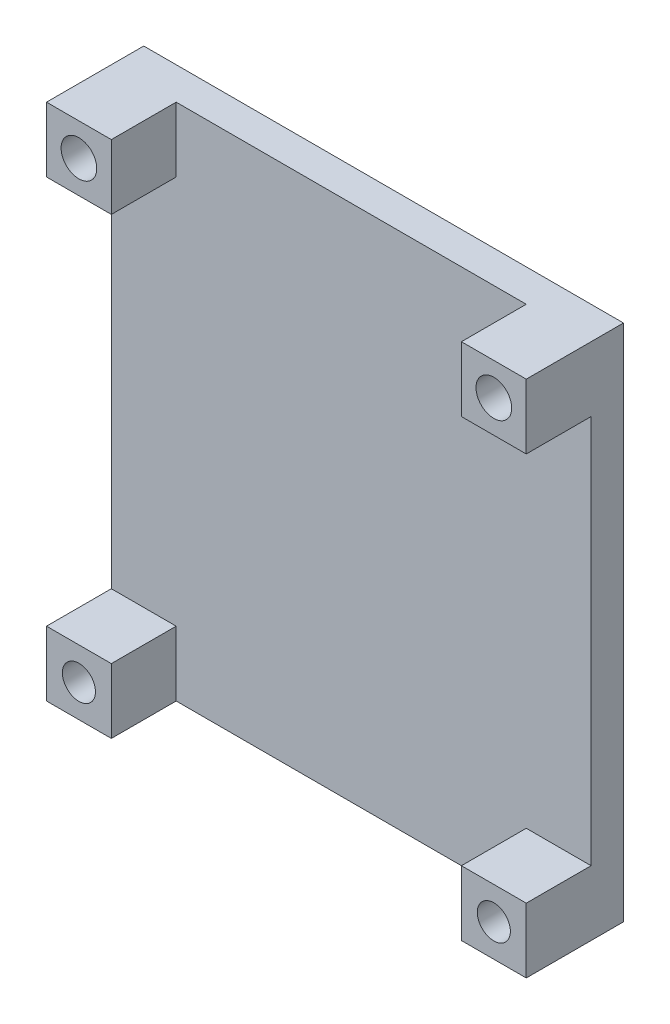
ISO-10303-21;
HEADER;
FILE_DESCRIPTION(('STEP AP214'),'2;1');
FILE_NAME('part.step','',(''),(''),'','','');
FILE_SCHEMA(('AUTOMOTIVE_DESIGN { 1 0 10303 214 1 1 1 1 }'));
ENDSEC;
DATA;
#1=APPLICATION_CONTEXT('core data for automotive mechanical design processes');
#2=APPLICATION_PROTOCOL_DEFINITION('international standard','automotive_design',2000,#1);
#3=PRODUCT_CONTEXT('',#1,'mechanical');
#4=PRODUCT('Part','Part','',(#3));
#5=PRODUCT_RELATED_PRODUCT_CATEGORY('part','',(#4));
#6=PRODUCT_DEFINITION_FORMATION('','',#4);
#7=PRODUCT_DEFINITION_CONTEXT('part definition',#1,'design');
#8=PRODUCT_DEFINITION('design','',#6,#7);
#9=PRODUCT_DEFINITION_SHAPE('','',#8);
#10=(LENGTH_UNIT() NAMED_UNIT(*) SI_UNIT(.MILLI.,.METRE.));
#11=(NAMED_UNIT(*) PLANE_ANGLE_UNIT() SI_UNIT($,.RADIAN.));
#12=(NAMED_UNIT(*) SI_UNIT($,.STERADIAN.) SOLID_ANGLE_UNIT());
#13=UNCERTAINTY_MEASURE_WITH_UNIT(LENGTH_MEASURE(1.E-05),#10,'distance_accuracy_value','');
#14=(GEOMETRIC_REPRESENTATION_CONTEXT(3) GLOBAL_UNCERTAINTY_ASSIGNED_CONTEXT((#13)) GLOBAL_UNIT_ASSIGNED_CONTEXT((#10,
#11,#12)) REPRESENTATION_CONTEXT('',''));
#15=CARTESIAN_POINT('',(0.,0.,0.));
#16=DIRECTION('',(0.,0.,1.));
#17=DIRECTION('',(1.,0.,0.));
#18=AXIS2_PLACEMENT_3D('',#15,#16,#17);
#19=CARTESIAN_POINT('',(0.,0.,5.));
#20=DIRECTION('',(0.,0.,-1.));
#21=DIRECTION('',(-1.,0.,0.));
#22=AXIS2_PLACEMENT_3D('',#19,#20,#21);
#23=PLANE('',#22);
#24=DIRECTION('',(1.,0.,0.));
#25=VECTOR('',#24,1.);
#26=CARTESIAN_POINT('',(0.,-28.7636253041362,5.));
#27=LINE('',#26,#25);
#28=CARTESIAN_POINT('',(-66.3018892791014,-28.7636253041362,5.));
#29=VERTEX_POINT('',#28);
#30=CARTESIAN_POINT('',(-56.3018892791014,-28.7636253041362,5.));
#31=VERTEX_POINT('',#30);
#32=EDGE_CURVE('E50',#29,#31,#27,.T.);
#33=ORIENTED_EDGE('',*,*,#32,.T.);
#34=DIRECTION('',(0.,-1.,0.));
#35=VECTOR('',#34,1.);
#36=CARTESIAN_POINT('',(-56.3018892791014,0.,5.));
#37=LINE('',#36,#35);
#38=CARTESIAN_POINT('',(-56.3018892791014,-38.7636253041362,5.));
#39=VERTEX_POINT('',#38);
#40=EDGE_CURVE('E154',#31,#39,#37,.T.);
#41=ORIENTED_EDGE('',*,*,#40,.T.);
#42=DIRECTION('',(1.,0.,0.));
#43=VECTOR('',#42,1.);
#44=CARTESIAN_POINT('',(7.6981107208986,-38.7636253041362,5.));
#45=LINE('',#44,#43);
#46=CARTESIAN_POINT('',(-2.30188927910142,-38.7636253041362,5.));
#47=VERTEX_POINT('',#46);
#48=EDGE_CURVE('E299',#39,#47,#45,.T.);
#49=ORIENTED_EDGE('',*,*,#48,.T.);
#50=DIRECTION('',(0.,-1.,0.));
#51=VECTOR('',#50,1.);
#52=CARTESIAN_POINT('',(-2.30188927910142,0.,5.));
#53=LINE('',#52,#51);
#54=CARTESIAN_POINT('',(-2.30188927910142,-28.7636253041362,5.));
#55=VERTEX_POINT('',#54);
#56=EDGE_CURVE('E190',#55,#47,#53,.T.);
#57=ORIENTED_EDGE('',*,*,#56,.F.);
#58=DIRECTION('',(-1.,0.,0.));
#59=VECTOR('',#58,1.);
#60=CARTESIAN_POINT('',(0.,-28.7636253041362,5.));
#61=LINE('',#60,#59);
#62=CARTESIAN_POINT('',(7.6981107208986,-28.7636253041362,5.));
#63=VERTEX_POINT('',#62);
#64=EDGE_CURVE('E157',#63,#55,#61,.T.);
#65=ORIENTED_EDGE('',*,*,#64,.F.);
#66=DIRECTION('',(0.,1.,0.));
#67=VECTOR('',#66,1.);
#68=CARTESIAN_POINT('',(7.69811072089859,41.2363746958637,5.));
#69=LINE('',#68,#67);
#70=CARTESIAN_POINT('',(7.69811072089859,31.2363746958638,5.));
#71=VERTEX_POINT('',#70);
#72=EDGE_CURVE('E273',#63,#71,#69,.T.);
#73=ORIENTED_EDGE('',*,*,#72,.T.);
#74=DIRECTION('',(1.,0.,0.));
#75=VECTOR('',#74,1.);
#76=CARTESIAN_POINT('',(0.,31.2363746958638,5.));
#77=LINE('',#76,#75);
#78=CARTESIAN_POINT('',(-2.30188927910142,31.2363746958638,5.));
#79=VERTEX_POINT('',#78);
#80=EDGE_CURVE('E218',#79,#71,#77,.T.);
#81=ORIENTED_EDGE('',*,*,#80,.F.);
#82=DIRECTION('',(0.,-1.,0.));
#83=VECTOR('',#82,1.);
#84=CARTESIAN_POINT('',(-2.30188927910142,0.,5.));
#85=LINE('',#84,#83);
#86=CARTESIAN_POINT('',(-2.30188927910142,41.2363746958637,5.));
#87=VERTEX_POINT('',#86);
#88=EDGE_CURVE('E213',#87,#79,#85,.T.);
#89=ORIENTED_EDGE('',*,*,#88,.F.);
#90=DIRECTION('',(-1.,0.,0.));
#91=VECTOR('',#90,1.);
#92=CARTESIAN_POINT('',(-66.3018892791014,41.2363746958637,5.));
#93=LINE('',#92,#91);
#94=CARTESIAN_POINT('',(-56.3018892791014,41.2363746958637,5.));
#95=VERTEX_POINT('',#94);
#96=EDGE_CURVE('E270',#87,#95,#93,.T.);
#97=ORIENTED_EDGE('',*,*,#96,.T.);
#98=DIRECTION('',(0.,-1.,0.));
#99=VECTOR('',#98,1.);
#100=CARTESIAN_POINT('',(-56.3018892791014,0.,5.));
#101=LINE('',#100,#99);
#102=CARTESIAN_POINT('',(-56.3018892791014,31.2363746958637,5.));
#103=VERTEX_POINT('',#102);
#104=EDGE_CURVE('E246',#95,#103,#101,.T.);
#105=ORIENTED_EDGE('',*,*,#104,.T.);
#106=DIRECTION('',(-1.,0.,0.));
#107=VECTOR('',#106,1.);
#108=CARTESIAN_POINT('',(0.,31.2363746958637,5.));
#109=LINE('',#108,#107);
#110=CARTESIAN_POINT('',(-66.3018892791014,31.2363746958637,5.));
#111=VERTEX_POINT('',#110);
#112=EDGE_CURVE('E260',#103,#111,#109,.T.);
#113=ORIENTED_EDGE('',*,*,#112,.T.);
#114=DIRECTION('',(0.,-1.,0.));
#115=VECTOR('',#114,1.);
#116=CARTESIAN_POINT('',(-66.3018892791014,-38.7636253041362,5.));
#117=LINE('',#116,#115);
#118=EDGE_CURVE('E55',#111,#29,#117,.T.);
#119=ORIENTED_EDGE('',*,*,#118,.T.);
#120=EDGE_LOOP('',(#33,#41,#49,#57,#65,#73,#81,#89,#97,#105,#113,#119));
#121=FACE_BOUND('',#120,.T.);
#122=ADVANCED_FACE('F35',(#121),#23,.F.);
#123=CARTESIAN_POINT('',(-66.3018892791014,-38.7636253041362,5.));
#124=DIRECTION('',(1.,0.,0.));
#125=DIRECTION('',(0.,0.,-1.));
#126=AXIS2_PLACEMENT_3D('',#123,#124,#125);
#127=PLANE('',#126);
#128=DIRECTION('',(0.,-1.,0.));
#129=VECTOR('',#128,1.);
#130=CARTESIAN_POINT('',(-66.3018892791014,-38.7636253041362,0.));
#131=LINE('',#130,#129);
#132=CARTESIAN_POINT('',(-66.3018892791014,41.2363746958637,0.));
#133=VERTEX_POINT('',#132);
#134=CARTESIAN_POINT('',(-66.3018892791014,-38.7636253041362,0.));
#135=VERTEX_POINT('',#134);
#136=EDGE_CURVE('E278',#133,#135,#131,.T.);
#137=ORIENTED_EDGE('',*,*,#136,.T.);
#138=DIRECTION('',(0.,0.,-1.));
#139=VECTOR('',#138,1.);
#140=CARTESIAN_POINT('',(-66.3018892791014,-38.7636253041362,5.));
#141=LINE('',#140,#139);
#142=CARTESIAN_POINT('',(-66.3018892791014,-38.7636253041362,15.));
#143=VERTEX_POINT('',#142);
#144=EDGE_CURVE('E295',#143,#135,#141,.T.);
#145=ORIENTED_EDGE('',*,*,#144,.F.);
#146=DIRECTION('',(0.,-1.,0.));
#147=VECTOR('',#146,1.);
#148=CARTESIAN_POINT('',(-66.3018892791014,0.,15.));
#149=LINE('',#148,#147);
#150=CARTESIAN_POINT('',(-66.3018892791014,-28.7636253041362,15.));
#151=VERTEX_POINT('',#150);
#152=EDGE_CURVE('E172',#151,#143,#149,.T.);
#153=ORIENTED_EDGE('',*,*,#152,.F.);
#154=DIRECTION('',(0.,0.,-1.));
#155=VECTOR('',#154,1.);
#156=CARTESIAN_POINT('',(-66.3018892791014,-28.7636253041362,15.));
#157=LINE('',#156,#155);
#158=EDGE_CURVE('E158',#151,#29,#157,.T.);
#159=ORIENTED_EDGE('',*,*,#158,.T.);
#160=ORIENTED_EDGE('',*,*,#118,.F.);
#161=DIRECTION('',(0.,0.,-1.));
#162=VECTOR('',#161,1.);
#163=CARTESIAN_POINT('',(-66.3018892791014,31.2363746958637,15.));
#164=LINE('',#163,#162);
#165=CARTESIAN_POINT('',(-66.3018892791014,31.2363746958637,15.));
#166=VERTEX_POINT('',#165);
#167=EDGE_CURVE('E257',#166,#111,#164,.T.);
#168=ORIENTED_EDGE('',*,*,#167,.F.);
#169=DIRECTION('',(0.,-1.,0.));
#170=VECTOR('',#169,1.);
#171=CARTESIAN_POINT('',(-66.3018892791014,0.,15.));
#172=LINE('',#171,#170);
#173=CARTESIAN_POINT('',(-66.3018892791014,41.2363746958637,15.));
#174=VERTEX_POINT('',#173);
#175=EDGE_CURVE('E255',#174,#166,#172,.T.);
#176=ORIENTED_EDGE('',*,*,#175,.F.);
#177=DIRECTION('',(0.,0.,-1.));
#178=VECTOR('',#177,1.);
#179=CARTESIAN_POINT('',(-66.3018892791014,41.2363746958637,5.));
#180=LINE('',#179,#178);
#181=EDGE_CURVE('E272',#174,#133,#180,.T.);
#182=ORIENTED_EDGE('',*,*,#181,.T.);
#183=EDGE_LOOP('',(#137,#145,#153,#159,#160,#168,#176,#182));
#184=FACE_BOUND('',#183,.T.);
#185=ADVANCED_FACE('F37',(#184),#127,.F.);
#186=CARTESIAN_POINT('',(7.6981107208986,-38.7636253041362,5.));
#187=DIRECTION('',(0.,1.,0.));
#188=DIRECTION('',(-1.,0.,0.));
#189=AXIS2_PLACEMENT_3D('',#186,#187,#188);
#190=PLANE('',#189);
#191=DIRECTION('',(1.,0.,0.));
#192=VECTOR('',#191,1.);
#193=CARTESIAN_POINT('',(7.6981107208986,-38.7636253041362,0.));
#194=LINE('',#193,#192);
#195=CARTESIAN_POINT('',(7.6981107208986,-38.7636253041362,0.));
#196=VERTEX_POINT('',#195);
#197=EDGE_CURVE('E281',#135,#196,#194,.T.);
#198=ORIENTED_EDGE('',*,*,#197,.T.);
#199=DIRECTION('',(0.,0.,-1.));
#200=VECTOR('',#199,1.);
#201=CARTESIAN_POINT('',(7.6981107208986,-38.7636253041362,5.));
#202=LINE('',#201,#200);
#203=CARTESIAN_POINT('',(7.6981107208986,-38.7636253041362,15.));
#204=VERTEX_POINT('',#203);
#205=EDGE_CURVE('E292',#204,#196,#202,.T.);
#206=ORIENTED_EDGE('',*,*,#205,.F.);
#207=DIRECTION('',(1.,0.,0.));
#208=VECTOR('',#207,1.);
#209=CARTESIAN_POINT('',(0.,-38.7636253041362,15.));
#210=LINE('',#209,#208);
#211=CARTESIAN_POINT('',(-2.30188927910142,-38.7636253041362,15.));
#212=VERTEX_POINT('',#211);
#213=EDGE_CURVE('E194',#212,#204,#210,.T.);
#214=ORIENTED_EDGE('',*,*,#213,.F.);
#215=DIRECTION('',(0.,0.,-1.));
#216=VECTOR('',#215,1.);
#217=CARTESIAN_POINT('',(-2.30188927910142,-38.7636253041362,15.));
#218=LINE('',#217,#216);
#219=EDGE_CURVE('E200',#212,#47,#218,.T.);
#220=ORIENTED_EDGE('',*,*,#219,.T.);
#221=ORIENTED_EDGE('',*,*,#48,.F.);
#222=DIRECTION('',(0.,0.,-1.));
#223=VECTOR('',#222,1.);
#224=CARTESIAN_POINT('',(-56.3018892791014,-38.7636253041362,15.));
#225=LINE('',#224,#223);
#226=CARTESIAN_POINT('',(-56.3018892791014,-38.7636253041362,15.));
#227=VERTEX_POINT('',#226);
#228=EDGE_CURVE('E178',#227,#39,#225,.T.);
#229=ORIENTED_EDGE('',*,*,#228,.F.);
#230=DIRECTION('',(1.,0.,0.));
#231=VECTOR('',#230,1.);
#232=CARTESIAN_POINT('',(0.,-38.7636253041362,15.));
#233=LINE('',#232,#231);
#234=EDGE_CURVE('E166',#143,#227,#233,.T.);
#235=ORIENTED_EDGE('',*,*,#234,.F.);
#236=ORIENTED_EDGE('',*,*,#144,.T.);
#237=EDGE_LOOP('',(#198,#206,#214,#220,#221,#229,#235,#236));
#238=FACE_BOUND('',#237,.T.);
#239=ADVANCED_FACE('F344',(#238),#190,.F.);
#240=CARTESIAN_POINT('',(7.69811072089859,41.2363746958637,5.));
#241=DIRECTION('',(-1.,0.,0.));
#242=DIRECTION('',(0.,-1.,0.));
#243=AXIS2_PLACEMENT_3D('',#240,#241,#242);
#244=PLANE('',#243);
#245=DIRECTION('',(0.,1.,0.));
#246=VECTOR('',#245,1.);
#247=CARTESIAN_POINT('',(7.69811072089859,41.2363746958637,0.));
#248=LINE('',#247,#246);
#249=CARTESIAN_POINT('',(7.69811072089859,41.2363746958637,0.));
#250=VERTEX_POINT('',#249);
#251=EDGE_CURVE('E283',#196,#250,#248,.T.);
#252=ORIENTED_EDGE('',*,*,#251,.T.);
#253=DIRECTION('',(0.,0.,-1.));
#254=VECTOR('',#253,1.);
#255=CARTESIAN_POINT('',(7.69811072089859,41.2363746958637,5.));
#256=LINE('',#255,#254);
#257=CARTESIAN_POINT('',(7.69811072089859,41.2363746958637,15.));
#258=VERTEX_POINT('',#257);
#259=EDGE_CURVE('E289',#258,#250,#256,.T.);
#260=ORIENTED_EDGE('',*,*,#259,.F.);
#261=DIRECTION('',(0.,1.,0.));
#262=VECTOR('',#261,1.);
#263=CARTESIAN_POINT('',(7.69811072089859,0.,15.));
#264=LINE('',#263,#262);
#265=CARTESIAN_POINT('',(7.69811072089859,31.2363746958638,15.));
#266=VERTEX_POINT('',#265);
#267=EDGE_CURVE('E222',#266,#258,#264,.T.);
#268=ORIENTED_EDGE('',*,*,#267,.F.);
#269=DIRECTION('',(0.,0.,-1.));
#270=VECTOR('',#269,1.);
#271=CARTESIAN_POINT('',(7.69811072089859,31.2363746958638,15.));
#272=LINE('',#271,#270);
#273=EDGE_CURVE('E228',#266,#71,#272,.T.);
#274=ORIENTED_EDGE('',*,*,#273,.T.);
#275=ORIENTED_EDGE('',*,*,#72,.F.);
#276=DIRECTION('',(0.,0.,-1.));
#277=VECTOR('',#276,1.);
#278=CARTESIAN_POINT('',(7.6981107208986,-28.7636253041362,15.));
#279=LINE('',#278,#277);
#280=CARTESIAN_POINT('',(7.6981107208986,-28.7636253041362,15.));
#281=VERTEX_POINT('',#280);
#282=EDGE_CURVE('E210',#281,#63,#279,.T.);
#283=ORIENTED_EDGE('',*,*,#282,.F.);
#284=DIRECTION('',(0.,1.,0.));
#285=VECTOR('',#284,1.);
#286=CARTESIAN_POINT('',(7.69811072089859,0.,15.));
#287=LINE('',#286,#285);
#288=EDGE_CURVE('E186',#204,#281,#287,.T.);
#289=ORIENTED_EDGE('',*,*,#288,.F.);
#290=ORIENTED_EDGE('',*,*,#205,.T.);
#291=EDGE_LOOP('',(#252,#260,#268,#274,#275,#283,#289,#290));
#292=FACE_BOUND('',#291,.T.);
#293=ADVANCED_FACE('F312',(#292),#244,.F.);
#294=CARTESIAN_POINT('',(-66.3018892791014,41.2363746958637,5.));
#295=DIRECTION('',(0.,-1.,0.));
#296=DIRECTION('',(0.,0.,-1.));
#297=AXIS2_PLACEMENT_3D('',#294,#295,#296);
#298=PLANE('',#297);
#299=DIRECTION('',(-1.,0.,0.));
#300=VECTOR('',#299,1.);
#301=CARTESIAN_POINT('',(-66.3018892791014,41.2363746958637,0.));
#302=LINE('',#301,#300);
#303=EDGE_CURVE('E285',#250,#133,#302,.T.);
#304=ORIENTED_EDGE('',*,*,#303,.T.);
#305=ORIENTED_EDGE('',*,*,#181,.F.);
#306=DIRECTION('',(-1.,0.,0.));
#307=VECTOR('',#306,1.);
#308=CARTESIAN_POINT('',(0.,41.2363746958637,15.));
#309=LINE('',#308,#307);
#310=CARTESIAN_POINT('',(-56.3018892791014,41.2363746958637,15.));
#311=VERTEX_POINT('',#310);
#312=EDGE_CURVE('E252',#311,#174,#309,.T.);
#313=ORIENTED_EDGE('',*,*,#312,.F.);
#314=DIRECTION('',(0.,0.,-1.));
#315=VECTOR('',#314,1.);
#316=CARTESIAN_POINT('',(-56.3018892791014,41.2363746958637,15.));
#317=LINE('',#316,#315);
#318=EDGE_CURVE('E300',#311,#95,#317,.T.);
#319=ORIENTED_EDGE('',*,*,#318,.T.);
#320=ORIENTED_EDGE('',*,*,#96,.F.);
#321=DIRECTION('',(0.,0.,-1.));
#322=VECTOR('',#321,1.);
#323=CARTESIAN_POINT('',(-2.30188927910142,41.2363746958637,15.));
#324=LINE('',#323,#322);
#325=CARTESIAN_POINT('',(-2.30188927910142,41.2363746958637,15.));
#326=VERTEX_POINT('',#325);
#327=EDGE_CURVE('E238',#326,#87,#324,.T.);
#328=ORIENTED_EDGE('',*,*,#327,.F.);
#329=DIRECTION('',(-1.,0.,0.));
#330=VECTOR('',#329,1.);
#331=CARTESIAN_POINT('',(0.,41.2363746958637,15.));
#332=LINE('',#331,#330);
#333=EDGE_CURVE('E214',#258,#326,#332,.T.);
#334=ORIENTED_EDGE('',*,*,#333,.F.);
#335=ORIENTED_EDGE('',*,*,#259,.T.);
#336=EDGE_LOOP('',(#304,#305,#313,#319,#320,#328,#334,#335));
#337=FACE_BOUND('',#336,.T.);
#338=ADVANCED_FACE('F319',(#337),#298,.F.);
#339=CARTESIAN_POINT('',(0.,0.,0.));
#340=DIRECTION('',(0.,0.,-1.));
#341=DIRECTION('',(-1.,0.,0.));
#342=AXIS2_PLACEMENT_3D('',#339,#340,#341);
#343=PLANE('',#342);
#344=ORIENTED_EDGE('',*,*,#136,.F.);
#345=ORIENTED_EDGE('',*,*,#303,.F.);
#346=ORIENTED_EDGE('',*,*,#251,.F.);
#347=ORIENTED_EDGE('',*,*,#197,.F.);
#348=EDGE_LOOP('',(#344,#345,#346,#347));
#349=FACE_BOUND('',#348,.T.);
#350=ADVANCED_FACE('F415',(#349),#343,.T.);
#351=CARTESIAN_POINT('',(0.,31.2363746958637,15.));
#352=DIRECTION('',(0.,-1.,0.));
#353=DIRECTION('',(0.,0.,-1.));
#354=AXIS2_PLACEMENT_3D('',#351,#352,#353);
#355=PLANE('',#354);
#356=ORIENTED_EDGE('',*,*,#112,.F.);
#357=DIRECTION('',(0.,0.,-1.));
#358=VECTOR('',#357,1.);
#359=CARTESIAN_POINT('',(-56.3018892791014,31.2363746958637,15.));
#360=LINE('',#359,#358);
#361=CARTESIAN_POINT('',(-56.3018892791014,31.2363746958637,15.));
#362=VERTEX_POINT('',#361);
#363=EDGE_CURVE('E263',#362,#103,#360,.T.);
#364=ORIENTED_EDGE('',*,*,#363,.F.);
#365=DIRECTION('',(-1.,0.,0.));
#366=VECTOR('',#365,1.);
#367=CARTESIAN_POINT('',(0.,31.2363746958637,15.));
#368=LINE('',#367,#366);
#369=EDGE_CURVE('E245',#362,#166,#368,.T.);
#370=ORIENTED_EDGE('',*,*,#369,.T.);
#371=ORIENTED_EDGE('',*,*,#167,.T.);
#372=EDGE_LOOP('',(#356,#364,#370,#371));
#373=FACE_BOUND('',#372,.T.);
#374=ADVANCED_FACE('F338',(#373),#355,.T.);
#375=CARTESIAN_POINT('',(-56.3018892791014,0.,15.));
#376=DIRECTION('',(1.,0.,0.));
#377=DIRECTION('',(0.,0.,-1.));
#378=AXIS2_PLACEMENT_3D('',#375,#376,#377);
#379=PLANE('',#378);
#380=ORIENTED_EDGE('',*,*,#104,.F.);
#381=ORIENTED_EDGE('',*,*,#318,.F.);
#382=DIRECTION('',(0.,-1.,0.));
#383=VECTOR('',#382,1.);
#384=CARTESIAN_POINT('',(-56.3018892791014,0.,15.));
#385=LINE('',#384,#383);
#386=EDGE_CURVE('E249',#311,#362,#385,.T.);
#387=ORIENTED_EDGE('',*,*,#386,.T.);
#388=ORIENTED_EDGE('',*,*,#363,.T.);
#389=EDGE_LOOP('',(#380,#381,#387,#388));
#390=FACE_BOUND('',#389,.T.);
#391=ADVANCED_FACE('F331',(#390),#379,.T.);
#392=CARTESIAN_POINT('',(-61.3018892791014,36.2363746958637,15.));
#393=DIRECTION('',(0.,0.,-1.));
#394=DIRECTION('',(-1.,0.,0.));
#395=AXIS2_PLACEMENT_3D('',#392,#393,#394);
#396=CYLINDRICAL_SURFACE('',#395,2.75);
#397=CARTESIAN_POINT('',(-61.3018892791014,36.2363746958637,15.));
#398=DIRECTION('',(0.,0.,1.));
#399=DIRECTION('',(1.,0.,0.));
#400=AXIS2_PLACEMENT_3D('',#397,#398,#399);
#401=CIRCLE('',#400,2.75);
#402=CARTESIAN_POINT('',(-58.5518892791014,36.2363746958637,15.));
#403=VERTEX_POINT('',#402);
#404=EDGE_CURVE('E242',#403,#403,#401,.T.);
#405=ORIENTED_EDGE('',*,*,#404,.T.);
#406=EDGE_LOOP('',(#405));
#407=FACE_BOUND('',#406,.T.);
#408=CARTESIAN_POINT('',(-61.3018892791014,36.2363746958637,5.));
#409=DIRECTION('',(0.,0.,1.));
#410=DIRECTION('',(1.,0.,0.));
#411=AXIS2_PLACEMENT_3D('',#408,#409,#410);
#412=CIRCLE('',#411,2.75);
#413=CARTESIAN_POINT('',(-58.5518892791014,36.2363746958637,5.));
#414=VERTEX_POINT('',#413);
#415=EDGE_CURVE('E241',#414,#414,#412,.T.);
#416=ORIENTED_EDGE('',*,*,#415,.F.);
#417=EDGE_LOOP('',(#416));
#418=FACE_BOUND('',#417,.T.);
#419=ADVANCED_FACE('F402',(#407,#418),#396,.F.);
#420=CARTESIAN_POINT('',(0.,0.,15.));
#421=DIRECTION('',(0.,0.,1.));
#422=DIRECTION('',(1.,0.,0.));
#423=AXIS2_PLACEMENT_3D('',#420,#421,#422);
#424=PLANE('',#423);
#425=ORIENTED_EDGE('',*,*,#404,.F.);
#426=EDGE_LOOP('',(#425));
#427=FACE_BOUND('',#426,.T.);
#428=ORIENTED_EDGE('',*,*,#369,.F.);
#429=ORIENTED_EDGE('',*,*,#386,.F.);
#430=ORIENTED_EDGE('',*,*,#312,.T.);
#431=ORIENTED_EDGE('',*,*,#175,.T.);
#432=EDGE_LOOP('',(#428,#429,#430,#431));
#433=FACE_BOUND('',#432,.T.);
#434=ADVANCED_FACE('F395',(#427,#433),#424,.T.);
#435=ORIENTED_EDGE('',*,*,#415,.T.);
#436=EDGE_LOOP('',(#435));
#437=FACE_BOUND('',#436,.T.);
#438=ADVANCED_FACE('F381',(#437),#23,.F.);
#439=CARTESIAN_POINT('',(-2.30188927910142,0.,15.));
#440=DIRECTION('',(1.,0.,0.));
#441=DIRECTION('',(0.,0.,-1.));
#442=AXIS2_PLACEMENT_3D('',#439,#440,#441);
#443=PLANE('',#442);
#444=ORIENTED_EDGE('',*,*,#88,.T.);
#445=DIRECTION('',(0.,0.,-1.));
#446=VECTOR('',#445,1.);
#447=CARTESIAN_POINT('',(-2.30188927910142,31.2363746958638,15.));
#448=LINE('',#447,#446);
#449=CARTESIAN_POINT('',(-2.30188927910142,31.2363746958638,15.));
#450=VERTEX_POINT('',#449);
#451=EDGE_CURVE('E235',#450,#79,#448,.T.);
#452=ORIENTED_EDGE('',*,*,#451,.F.);
#453=DIRECTION('',(0.,-1.,0.));
#454=VECTOR('',#453,1.);
#455=CARTESIAN_POINT('',(-2.30188927910142,0.,15.));
#456=LINE('',#455,#454);
#457=EDGE_CURVE('E217',#326,#450,#456,.T.);
#458=ORIENTED_EDGE('',*,*,#457,.F.);
#459=ORIENTED_EDGE('',*,*,#327,.T.);
#460=EDGE_LOOP('',(#444,#452,#458,#459));
#461=FACE_BOUND('',#460,.T.);
#462=ADVANCED_FACE('F324',(#461),#443,.F.);
#463=CARTESIAN_POINT('',(0.,31.2363746958638,15.));
#464=DIRECTION('',(0.,1.,0.));
#465=DIRECTION('',(0.,0.,1.));
#466=AXIS2_PLACEMENT_3D('',#463,#464,#465);
#467=PLANE('',#466);
#468=ORIENTED_EDGE('',*,*,#80,.T.);
#469=ORIENTED_EDGE('',*,*,#273,.F.);
#470=DIRECTION('',(1.,0.,0.));
#471=VECTOR('',#470,1.);
#472=CARTESIAN_POINT('',(0.,31.2363746958638,15.));
#473=LINE('',#472,#471);
#474=EDGE_CURVE('E220',#450,#266,#473,.T.);
#475=ORIENTED_EDGE('',*,*,#474,.F.);
#476=ORIENTED_EDGE('',*,*,#451,.T.);
#477=EDGE_LOOP('',(#468,#469,#475,#476));
#478=FACE_BOUND('',#477,.T.);
#479=ADVANCED_FACE('F308',(#478),#467,.F.);
#480=CARTESIAN_POINT('',(2.69811072089858,36.2363746958637,15.));
#481=DIRECTION('',(0.,0.,-1.));
#482=DIRECTION('',(-1.,0.,0.));
#483=AXIS2_PLACEMENT_3D('',#480,#481,#482);
#484=CYLINDRICAL_SURFACE('',#483,2.75);
#485=CARTESIAN_POINT('',(2.69811072089858,36.2363746958637,15.));
#486=DIRECTION('',(0.,0.,1.));
#487=DIRECTION('',(1.,0.,0.));
#488=AXIS2_PLACEMENT_3D('',#485,#486,#487);
#489=CIRCLE('',#488,2.75);
#490=CARTESIAN_POINT('',(5.44811072089858,36.2363746958637,15.));
#491=VERTEX_POINT('',#490);
#492=EDGE_CURVE('E225',#491,#491,#489,.F.);
#493=ORIENTED_EDGE('',*,*,#492,.F.);
#494=EDGE_LOOP('',(#493));
#495=FACE_BOUND('',#494,.T.);
#496=CARTESIAN_POINT('',(2.69811072089858,36.2363746958637,5.));
#497=DIRECTION('',(0.,0.,-1.));
#498=DIRECTION('',(-1.,0.,0.));
#499=AXIS2_PLACEMENT_3D('',#496,#497,#498);
#500=CIRCLE('',#499,2.75);
#501=CARTESIAN_POINT('',(-0.0518892791014198,36.2363746958637,5.));
#502=VERTEX_POINT('',#501);
#503=EDGE_CURVE('E43',#502,#502,#500,.T.);
#504=ORIENTED_EDGE('',*,*,#503,.T.);
#505=EDGE_LOOP('',(#504));
#506=FACE_BOUND('',#505,.T.);
#507=ADVANCED_FACE('F419',(#495,#506),#484,.F.);
#508=CARTESIAN_POINT('',(0.,0.,15.));
#509=DIRECTION('',(0.,0.,1.));
#510=DIRECTION('',(1.,0.,0.));
#511=AXIS2_PLACEMENT_3D('',#508,#509,#510);
#512=PLANE('',#511);
#513=ORIENTED_EDGE('',*,*,#333,.T.);
#514=ORIENTED_EDGE('',*,*,#457,.T.);
#515=ORIENTED_EDGE('',*,*,#474,.T.);
#516=ORIENTED_EDGE('',*,*,#267,.T.);
#517=EDGE_LOOP('',(#513,#514,#515,#516));
#518=FACE_BOUND('',#517,.T.);
#519=ORIENTED_EDGE('',*,*,#492,.T.);
#520=EDGE_LOOP('',(#519));
#521=FACE_BOUND('',#520,.T.);
#522=ADVANCED_FACE('F315',(#518,#521),#512,.T.);
#523=ORIENTED_EDGE('',*,*,#503,.F.);
#524=EDGE_LOOP('',(#523));
#525=FACE_BOUND('',#524,.T.);
#526=ADVANCED_FACE('F371',(#525),#23,.F.);
#527=CARTESIAN_POINT('',(0.,-28.7636253041362,15.));
#528=DIRECTION('',(0.,-1.,0.));
#529=DIRECTION('',(0.,0.,-1.));
#530=AXIS2_PLACEMENT_3D('',#527,#528,#529);
#531=PLANE('',#530);
#532=ORIENTED_EDGE('',*,*,#64,.T.);
#533=DIRECTION('',(0.,0.,-1.));
#534=VECTOR('',#533,1.);
#535=CARTESIAN_POINT('',(-2.30188927910142,-28.7636253041362,15.));
#536=LINE('',#535,#534);
#537=CARTESIAN_POINT('',(-2.30188927910142,-28.7636253041362,15.));
#538=VERTEX_POINT('',#537);
#539=EDGE_CURVE('E207',#538,#55,#536,.T.);
#540=ORIENTED_EDGE('',*,*,#539,.F.);
#541=DIRECTION('',(-1.,0.,0.));
#542=VECTOR('',#541,1.);
#543=CARTESIAN_POINT('',(0.,-28.7636253041362,15.));
#544=LINE('',#543,#542);
#545=EDGE_CURVE('E189',#281,#538,#544,.T.);
#546=ORIENTED_EDGE('',*,*,#545,.F.);
#547=ORIENTED_EDGE('',*,*,#282,.T.);
#548=EDGE_LOOP('',(#532,#540,#546,#547));
#549=FACE_BOUND('',#548,.T.);
#550=ADVANCED_FACE('F352',(#549),#531,.F.);
#551=CARTESIAN_POINT('',(-2.30188927910142,0.,15.));
#552=DIRECTION('',(1.,0.,0.));
#553=DIRECTION('',(0.,0.,-1.));
#554=AXIS2_PLACEMENT_3D('',#551,#552,#553);
#555=PLANE('',#554);
#556=ORIENTED_EDGE('',*,*,#56,.T.);
#557=ORIENTED_EDGE('',*,*,#219,.F.);
#558=DIRECTION('',(0.,-1.,0.));
#559=VECTOR('',#558,1.);
#560=CARTESIAN_POINT('',(-2.30188927910142,0.,15.));
#561=LINE('',#560,#559);
#562=EDGE_CURVE('E192',#538,#212,#561,.T.);
#563=ORIENTED_EDGE('',*,*,#562,.F.);
#564=ORIENTED_EDGE('',*,*,#539,.T.);
#565=EDGE_LOOP('',(#556,#557,#563,#564));
#566=FACE_BOUND('',#565,.T.);
#567=ADVANCED_FACE('F349',(#566),#555,.F.);
#568=CARTESIAN_POINT('',(2.69811072089858,-33.7636253041362,15.));
#569=DIRECTION('',(0.,0.,-1.));
#570=DIRECTION('',(-1.,0.,0.));
#571=AXIS2_PLACEMENT_3D('',#568,#569,#570);
#572=CYLINDRICAL_SURFACE('',#571,2.55);
#573=CARTESIAN_POINT('',(2.69811072089858,-33.7636253041362,15.));
#574=DIRECTION('',(0.,0.,1.));
#575=DIRECTION('',(1.,0.,0.));
#576=AXIS2_PLACEMENT_3D('',#573,#574,#575);
#577=CIRCLE('',#576,2.55);
#578=CARTESIAN_POINT('',(5.24811072089858,-33.7636253041362,15.));
#579=VERTEX_POINT('',#578);
#580=EDGE_CURVE('E197',#579,#579,#577,.F.);
#581=ORIENTED_EDGE('',*,*,#580,.F.);
#582=EDGE_LOOP('',(#581));
#583=FACE_BOUND('',#582,.T.);
#584=CARTESIAN_POINT('',(2.69811072089858,-33.7636253041362,5.));
#585=DIRECTION('',(0.,0.,-1.));
#586=DIRECTION('',(-1.,0.,0.));
#587=AXIS2_PLACEMENT_3D('',#584,#585,#586);
#588=CIRCLE('',#587,2.55);
#589=CARTESIAN_POINT('',(0.148110720898582,-33.7636253041362,5.));
#590=VERTEX_POINT('',#589);
#591=EDGE_CURVE('E11',#590,#590,#588,.T.);
#592=ORIENTED_EDGE('',*,*,#591,.T.);
#593=EDGE_LOOP('',(#592));
#594=FACE_BOUND('',#593,.T.);
#595=ADVANCED_FACE('F360',(#583,#594),#572,.F.);
#596=CARTESIAN_POINT('',(0.,0.,15.));
#597=DIRECTION('',(0.,0.,1.));
#598=DIRECTION('',(1.,0.,0.));
#599=AXIS2_PLACEMENT_3D('',#596,#597,#598);
#600=PLANE('',#599);
#601=ORIENTED_EDGE('',*,*,#288,.T.);
#602=ORIENTED_EDGE('',*,*,#545,.T.);
#603=ORIENTED_EDGE('',*,*,#562,.T.);
#604=ORIENTED_EDGE('',*,*,#213,.T.);
#605=EDGE_LOOP('',(#601,#602,#603,#604));
#606=FACE_BOUND('',#605,.T.);
#607=ORIENTED_EDGE('',*,*,#580,.T.);
#608=EDGE_LOOP('',(#607));
#609=FACE_BOUND('',#608,.T.);
#610=ADVANCED_FACE('F356',(#606,#609),#600,.T.);
#611=ORIENTED_EDGE('',*,*,#591,.F.);
#612=EDGE_LOOP('',(#611));
#613=FACE_BOUND('',#612,.T.);
#614=ADVANCED_FACE('F359',(#613),#23,.F.);
#615=CARTESIAN_POINT('',(-56.3018892791014,0.,15.));
#616=DIRECTION('',(1.,0.,0.));
#617=DIRECTION('',(0.,0.,-1.));
#618=AXIS2_PLACEMENT_3D('',#615,#616,#617);
#619=PLANE('',#618);
#620=ORIENTED_EDGE('',*,*,#40,.F.);
#621=DIRECTION('',(0.,0.,-1.));
#622=VECTOR('',#621,1.);
#623=CARTESIAN_POINT('',(-56.3018892791014,-28.7636253041362,15.));
#624=LINE('',#623,#622);
#625=CARTESIAN_POINT('',(-56.3018892791014,-28.7636253041362,15.));
#626=VERTEX_POINT('',#625);
#627=EDGE_CURVE('E149',#626,#31,#624,.T.);
#628=ORIENTED_EDGE('',*,*,#627,.F.);
#629=DIRECTION('',(0.,-1.,0.));
#630=VECTOR('',#629,1.);
#631=CARTESIAN_POINT('',(-56.3018892791014,0.,15.));
#632=LINE('',#631,#630);
#633=EDGE_CURVE('E153',#626,#227,#632,.T.);
#634=ORIENTED_EDGE('',*,*,#633,.T.);
#635=ORIENTED_EDGE('',*,*,#228,.T.);
#636=EDGE_LOOP('',(#620,#628,#634,#635));
#637=FACE_BOUND('',#636,.T.);
#638=ADVANCED_FACE('F151',(#637),#619,.T.);
#639=CARTESIAN_POINT('',(0.,-28.7636253041362,15.));
#640=DIRECTION('',(0.,1.,0.));
#641=DIRECTION('',(0.,0.,1.));
#642=AXIS2_PLACEMENT_3D('',#639,#640,#641);
#643=PLANE('',#642);
#644=ORIENTED_EDGE('',*,*,#32,.F.);
#645=ORIENTED_EDGE('',*,*,#158,.F.);
#646=DIRECTION('',(1.,0.,0.));
#647=VECTOR('',#646,1.);
#648=CARTESIAN_POINT('',(0.,-28.7636253041362,15.));
#649=LINE('',#648,#647);
#650=EDGE_CURVE('E164',#151,#626,#649,.T.);
#651=ORIENTED_EDGE('',*,*,#650,.T.);
#652=ORIENTED_EDGE('',*,*,#627,.T.);
#653=EDGE_LOOP('',(#644,#645,#651,#652));
#654=FACE_BOUND('',#653,.T.);
#655=ADVANCED_FACE('F170',(#654),#643,.T.);
#656=CARTESIAN_POINT('',(-61.3018892791014,-33.7636253041362,15.));
#657=DIRECTION('',(0.,0.,-1.));
#658=DIRECTION('',(-1.,0.,0.));
#659=AXIS2_PLACEMENT_3D('',#656,#657,#658);
#660=CYLINDRICAL_SURFACE('',#659,2.55);
#661=CARTESIAN_POINT('',(-61.3018892791014,-33.7636253041362,15.));
#662=DIRECTION('',(0.,0.,1.));
#663=DIRECTION('',(1.,0.,0.));
#664=AXIS2_PLACEMENT_3D('',#661,#662,#663);
#665=CIRCLE('',#664,2.55);
#666=CARTESIAN_POINT('',(-58.7518892791014,-33.7636253041362,15.));
#667=VERTEX_POINT('',#666);
#668=EDGE_CURVE('E168',#667,#667,#665,.T.);
#669=ORIENTED_EDGE('',*,*,#668,.T.);
#670=EDGE_LOOP('',(#669));
#671=FACE_BOUND('',#670,.T.);
#672=CARTESIAN_POINT('',(-61.3018892791014,-33.7636253041362,5.));
#673=DIRECTION('',(0.,0.,1.));
#674=DIRECTION('',(1.,0.,0.));
#675=AXIS2_PLACEMENT_3D('',#672,#673,#674);
#676=CIRCLE('',#675,2.55);
#677=CARTESIAN_POINT('',(-58.7518892791014,-33.7636253041362,5.));
#678=VERTEX_POINT('',#677);
#679=EDGE_CURVE('E179',#678,#678,#676,.T.);
#680=ORIENTED_EDGE('',*,*,#679,.F.);
#681=EDGE_LOOP('',(#680));
#682=FACE_BOUND('',#681,.T.);
#683=ADVANCED_FACE('F391',(#671,#682),#660,.F.);
#684=CARTESIAN_POINT('',(0.,0.,15.));
#685=DIRECTION('',(0.,0.,1.));
#686=DIRECTION('',(1.,0.,0.));
#687=AXIS2_PLACEMENT_3D('',#684,#685,#686);
#688=PLANE('',#687);
#689=ORIENTED_EDGE('',*,*,#668,.F.);
#690=EDGE_LOOP('',(#689));
#691=FACE_BOUND('',#690,.T.);
#692=ORIENTED_EDGE('',*,*,#633,.F.);
#693=ORIENTED_EDGE('',*,*,#650,.F.);
#694=ORIENTED_EDGE('',*,*,#152,.T.);
#695=ORIENTED_EDGE('',*,*,#234,.T.);
#696=EDGE_LOOP('',(#692,#693,#694,#695));
#697=FACE_BOUND('',#696,.T.);
#698=ADVANCED_FACE('F162',(#691,#697),#688,.T.);
#699=ORIENTED_EDGE('',*,*,#679,.T.);
#700=EDGE_LOOP('',(#699));
#701=FACE_BOUND('',#700,.T.);
#702=ADVANCED_FACE('F376',(#701),#23,.F.);
#703=CLOSED_SHELL('',(#122,#185,#239,#293,#338,#350,#374,#391,#419,#434,#438,#462,#479,#507,
#522,#526,#550,#567,#595,#610,#614,#638,#655,#683,#698,#702));
#704=MANIFOLD_SOLID_BREP('B2',#703);
#705=ADVANCED_BREP_SHAPE_REPRESENTATION('',(#18,#704),#14);
#706=SHAPE_DEFINITION_REPRESENTATION(#9,#705);
ENDSEC;
END-ISO-10303-21;
